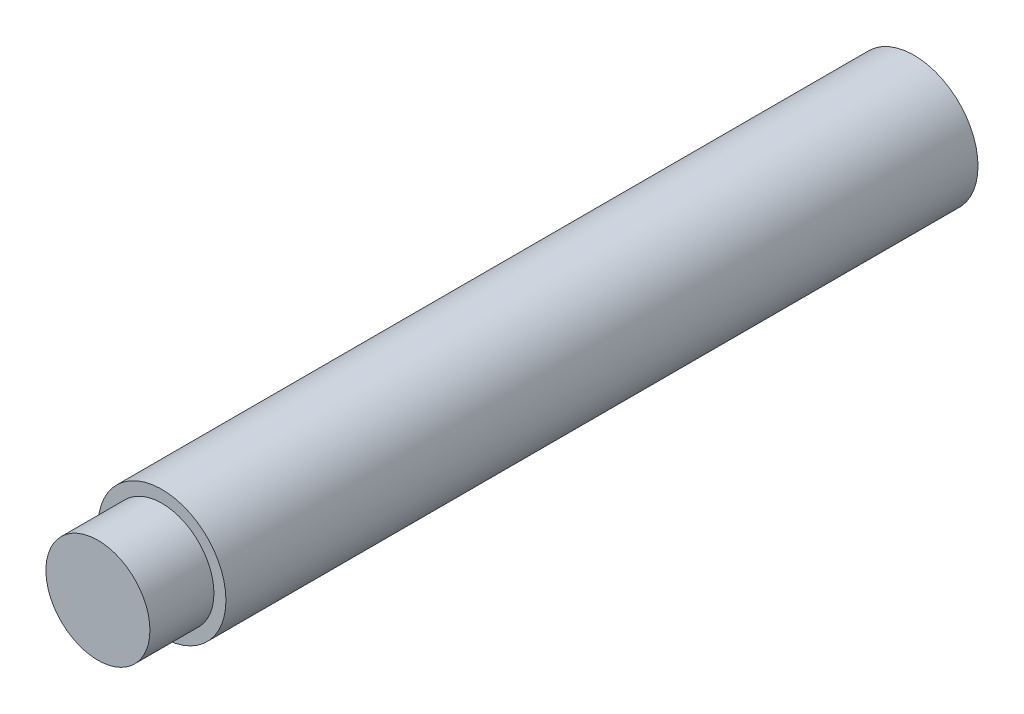
ISO-10303-21;
HEADER;
FILE_DESCRIPTION(('STEP AP214'),'2;1');
FILE_NAME('part.step','',(''),(''),'','','');
FILE_SCHEMA(('AUTOMOTIVE_DESIGN { 1 0 10303 214 1 1 1 1 }'));
ENDSEC;
DATA;
#1=APPLICATION_CONTEXT('core data for automotive mechanical design processes');
#2=APPLICATION_PROTOCOL_DEFINITION('international standard','automotive_design',2000,#1);
#3=PRODUCT_CONTEXT('',#1,'mechanical');
#4=PRODUCT('Part','Part','',(#3));
#5=PRODUCT_RELATED_PRODUCT_CATEGORY('part','',(#4));
#6=PRODUCT_DEFINITION_FORMATION('','',#4);
#7=PRODUCT_DEFINITION_CONTEXT('part definition',#1,'design');
#8=PRODUCT_DEFINITION('design','',#6,#7);
#9=PRODUCT_DEFINITION_SHAPE('','',#8);
#10=(LENGTH_UNIT() NAMED_UNIT(*) SI_UNIT(.MILLI.,.METRE.));
#11=(NAMED_UNIT(*) PLANE_ANGLE_UNIT() SI_UNIT($,.RADIAN.));
#12=(NAMED_UNIT(*) SI_UNIT($,.STERADIAN.) SOLID_ANGLE_UNIT());
#13=UNCERTAINTY_MEASURE_WITH_UNIT(LENGTH_MEASURE(1.E-05),#10,'distance_accuracy_value','');
#14=(GEOMETRIC_REPRESENTATION_CONTEXT(3) GLOBAL_UNCERTAINTY_ASSIGNED_CONTEXT((#13)) GLOBAL_UNIT_ASSIGNED_CONTEXT((#10,
#11,#12)) REPRESENTATION_CONTEXT('',''));
#15=CARTESIAN_POINT('',(0.,0.,0.));
#16=DIRECTION('',(0.,0.,1.));
#17=DIRECTION('',(1.,0.,0.));
#18=AXIS2_PLACEMENT_3D('',#15,#16,#17);
#19=CARTESIAN_POINT('',(0.,0.,47.));
#20=DIRECTION('',(0.,0.,-1.));
#21=DIRECTION('',(-1.,0.,0.));
#22=AXIS2_PLACEMENT_3D('',#19,#20,#21);
#23=CYLINDRICAL_SURFACE('',#22,4.);
#24=CARTESIAN_POINT('',(0.,0.,47.));
#25=DIRECTION('',(0.,0.,1.));
#26=DIRECTION('',(1.,0.,0.));
#27=AXIS2_PLACEMENT_3D('',#24,#25,#26);
#28=CIRCLE('',#27,4.);
#29=CARTESIAN_POINT('',(4.,0.,47.));
#30=VERTEX_POINT('',#29);
#31=EDGE_CURVE('E49',#30,#30,#28,.T.);
#32=ORIENTED_EDGE('',*,*,#31,.F.);
#33=EDGE_LOOP('',(#32));
#34=FACE_BOUND('',#33,.T.);
#35=CARTESIAN_POINT('',(0.,0.,0.));
#36=DIRECTION('',(0.,0.,1.));
#37=DIRECTION('',(1.,0.,0.));
#38=AXIS2_PLACEMENT_3D('',#35,#36,#37);
#39=CIRCLE('',#38,4.);
#40=CARTESIAN_POINT('',(4.,0.,0.));
#41=VERTEX_POINT('',#40);
#42=EDGE_CURVE('E44',#41,#41,#39,.T.);
#43=ORIENTED_EDGE('',*,*,#42,.T.);
#44=EDGE_LOOP('',(#43));
#45=FACE_BOUND('',#44,.T.);
#46=ADVANCED_FACE('F41',(#34,#45),#23,.T.);
#47=CARTESIAN_POINT('',(0.,0.,47.));
#48=DIRECTION('',(0.,0.,1.));
#49=DIRECTION('',(1.,0.,0.));
#50=AXIS2_PLACEMENT_3D('',#47,#48,#49);
#51=PLANE('',#50);
#52=CARTESIAN_POINT('',(0.,0.,47.));
#53=DIRECTION('',(0.,0.,1.));
#54=DIRECTION('',(1.,0.,0.));
#55=AXIS2_PLACEMENT_3D('',#52,#53,#54);
#56=CIRCLE('',#55,3.25);
#57=CARTESIAN_POINT('',(3.25,0.,47.));
#58=VERTEX_POINT('',#57);
#59=EDGE_CURVE('E10',#58,#58,#56,.T.);
#60=ORIENTED_EDGE('',*,*,#59,.F.);
#61=EDGE_LOOP('',(#60));
#62=FACE_BOUND('',#61,.T.);
#63=ORIENTED_EDGE('',*,*,#31,.T.);
#64=EDGE_LOOP('',(#63));
#65=FACE_BOUND('',#64,.T.);
#66=ADVANCED_FACE('F69',(#62,#65),#51,.T.);
#67=CARTESIAN_POINT('',(0.,0.,0.));
#68=DIRECTION('',(0.,0.,1.));
#69=DIRECTION('',(1.,0.,0.));
#70=AXIS2_PLACEMENT_3D('',#67,#68,#69);
#71=PLANE('',#70);
#72=ORIENTED_EDGE('',*,*,#42,.F.);
#73=EDGE_LOOP('',(#72));
#74=FACE_BOUND('',#73,.T.);
#75=ADVANCED_FACE('F66',(#74),#71,.F.);
#76=CARTESIAN_POINT('',(0.,0.,51.));
#77=DIRECTION('',(0.,0.,-1.));
#78=DIRECTION('',(-1.,0.,0.));
#79=AXIS2_PLACEMENT_3D('',#76,#77,#78);
#80=CYLINDRICAL_SURFACE('',#79,3.25);
#81=CARTESIAN_POINT('',(0.,0.,51.));
#82=DIRECTION('',(0.,0.,1.));
#83=DIRECTION('',(1.,0.,0.));
#84=AXIS2_PLACEMENT_3D('',#81,#82,#83);
#85=CIRCLE('',#84,3.25);
#86=CARTESIAN_POINT('',(3.25,0.,51.));
#87=VERTEX_POINT('',#86);
#88=EDGE_CURVE('E56',#87,#87,#85,.T.);
#89=ORIENTED_EDGE('',*,*,#88,.F.);
#90=EDGE_LOOP('',(#89));
#91=FACE_BOUND('',#90,.T.);
#92=ORIENTED_EDGE('',*,*,#59,.T.);
#93=EDGE_LOOP('',(#92));
#94=FACE_BOUND('',#93,.T.);
#95=ADVANCED_FACE('F68',(#91,#94),#80,.T.);
#96=CARTESIAN_POINT('',(0.,0.,51.));
#97=DIRECTION('',(0.,0.,1.));
#98=DIRECTION('',(1.,0.,0.));
#99=AXIS2_PLACEMENT_3D('',#96,#97,#98);
#100=PLANE('',#99);
#101=ORIENTED_EDGE('',*,*,#88,.T.);
#102=EDGE_LOOP('',(#101));
#103=FACE_BOUND('',#102,.T.);
#104=ADVANCED_FACE('F74',(#103),#100,.T.);
#105=CLOSED_SHELL('',(#46,#66,#75,#95,#104));
#106=MANIFOLD_SOLID_BREP('B2',#105);
#107=ADVANCED_BREP_SHAPE_REPRESENTATION('',(#18,#106),#14);
#108=SHAPE_DEFINITION_REPRESENTATION(#9,#107);
ENDSEC;
END-ISO-10303-21;
